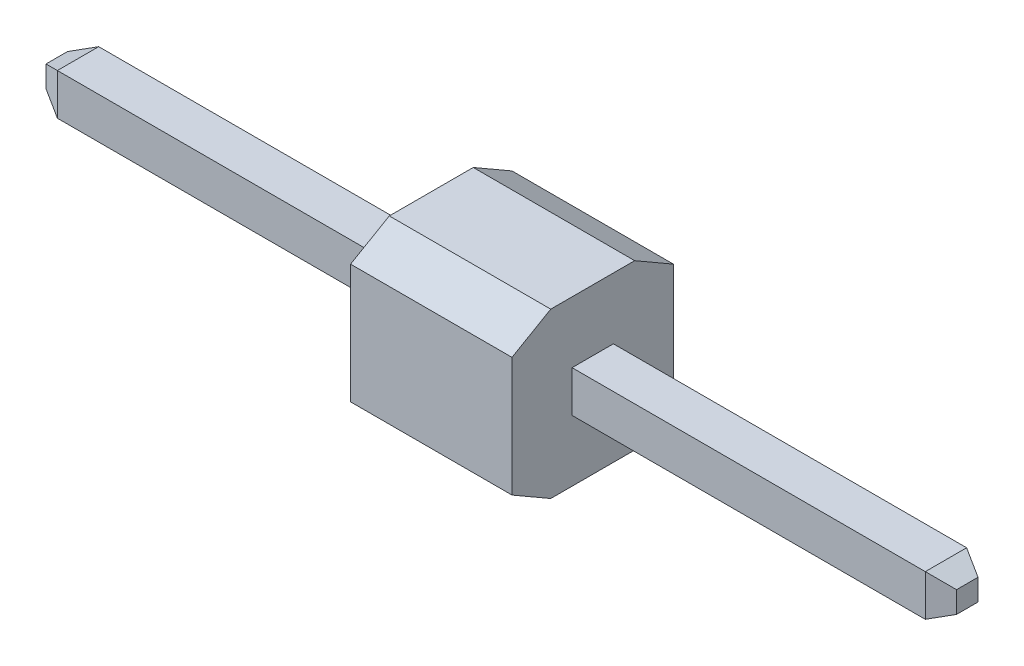
ISO-10303-21;
HEADER;
FILE_DESCRIPTION(('STEP AP214'),'2;1');
FILE_NAME('part.step','',(''),(''),'','','');
FILE_SCHEMA(('AUTOMOTIVE_DESIGN { 1 0 10303 214 1 1 1 1 }'));
ENDSEC;
DATA;
#1=APPLICATION_CONTEXT('core data for automotive mechanical design processes');
#2=APPLICATION_PROTOCOL_DEFINITION('international standard','automotive_design',2000,#1);
#3=PRODUCT_CONTEXT('',#1,'mechanical');
#4=PRODUCT('Part','Part','',(#3));
#5=PRODUCT_RELATED_PRODUCT_CATEGORY('part','',(#4));
#6=PRODUCT_DEFINITION_FORMATION('','',#4);
#7=PRODUCT_DEFINITION_CONTEXT('part definition',#1,'design');
#8=PRODUCT_DEFINITION('design','',#6,#7);
#9=PRODUCT_DEFINITION_SHAPE('','',#8);
#10=(LENGTH_UNIT() NAMED_UNIT(*) SI_UNIT(.MILLI.,.METRE.));
#11=(NAMED_UNIT(*) PLANE_ANGLE_UNIT() SI_UNIT($,.RADIAN.));
#12=(NAMED_UNIT(*) SI_UNIT($,.STERADIAN.) SOLID_ANGLE_UNIT());
#13=UNCERTAINTY_MEASURE_WITH_UNIT(LENGTH_MEASURE(1.E-05),#10,'distance_accuracy_value','');
#14=(GEOMETRIC_REPRESENTATION_CONTEXT(3) GLOBAL_UNCERTAINTY_ASSIGNED_CONTEXT((#13)) GLOBAL_UNIT_ASSIGNED_CONTEXT((#10,
#11,#12)) REPRESENTATION_CONTEXT('',''));
#15=CARTESIAN_POINT('',(0.,0.,0.));
#16=DIRECTION('',(0.,0.,1.));
#17=DIRECTION('',(1.,0.,0.));
#18=AXIS2_PLACEMENT_3D('',#15,#16,#17);
#19=CARTESIAN_POINT('',(5.42110095234498,5.39711572605714,-2.77112103967247));
#20=DIRECTION('',(1.,-9.93476518829084E-08,4.37113882867379E-08));
#21=DIRECTION('',(-9.93476589883358E-08,-1.,8.74227765734759E-08));
#22=AXIS2_PLACEMENT_3D('',#19,#20,#21);
#23=PLANE('',#22);
#24=DIRECTION('',(-1.18186619959584E-08,-0.500000075710541,-0.866025360072933));
#25=VECTOR('',#24,1.);
#26=CARTESIAN_POINT('',(5.42110076017037,4.15352602482091,-1.20112093095439));
#27=LINE('',#26,#25);
#28=CARTESIAN_POINT('',(5.42110076017037,4.15352602482091,-1.20112093095439));
#29=VERTEX_POINT('',#28);
#30=CARTESIAN_POINT('',(5.42110075198216,3.80711581085724,-1.80112090067026));
#31=VERTEX_POINT('',#30);
#32=EDGE_CURVE('E11',#29,#31,#27,.T.);
#33=ORIENTED_EDGE('',*,*,#32,.T.);
#34=DIRECTION('',(4.37113811813104E-08,-8.74227814926175E-08,-0.999999999999995));
#35=VECTOR('',#34,1.);
#36=CARTESIAN_POINT('',(5.42110075198216,3.80711581085724,-1.80112090067026));
#37=LINE('',#36,#35);
#38=CARTESIAN_POINT('',(5.42110080880696,3.80711569720762,-3.10112090067026));
#39=VERTEX_POINT('',#38);
#40=EDGE_CURVE('E304',#31,#39,#37,.T.);
#41=ORIENTED_EDGE('',*,*,#40,.T.);
#42=DIRECTION('',(8.75289950712043E-08,0.499999924289839,-0.866025447495711));
#43=VECTOR('',#42,1.);
#44=CARTESIAN_POINT('',(5.42110080880696,3.80711569720762,-3.10112090067026));
#45=LINE('',#44,#43);
#46=CARTESIAN_POINT('',(5.42110086944883,4.15352580626395,-3.70112093095439));
#47=VERTEX_POINT('',#46);
#48=EDGE_CURVE('E296',#39,#47,#45,.T.);
#49=ORIENTED_EDGE('',*,*,#48,.T.);
#50=DIRECTION('',(9.93476593244772E-08,0.999999999999991,-8.74227764822788E-08));
#51=VECTOR('',#50,1.);
#52=CARTESIAN_POINT('',(5.42110086944883,4.15352580626395,-3.70112093095439));
#53=LINE('',#52,#51);
#54=CARTESIAN_POINT('',(5.4211010529618,6.00070548323395,-3.70112109243997));
#55=VERTEX_POINT('',#54);
#56=EDGE_CURVE('E281',#47,#55,#53,.T.);
#57=ORIENTED_EDGE('',*,*,#56,.T.);
#58=DIRECTION('',(-1.18186632778483E-08,-0.500000075710533,-0.866025360072938));
#59=VECTOR('',#58,1.);
#60=CARTESIAN_POINT('',(5.42110106115001,6.34711569720762,-3.10112112272411));
#61=LINE('',#60,#59);
#62=CARTESIAN_POINT('',(5.42110106115001,6.34711569720762,-3.10112112272411));
#63=VERTEX_POINT('',#62);
#64=EDGE_CURVE('E265',#63,#55,#61,.T.);
#65=ORIENTED_EDGE('',*,*,#64,.F.);
#66=DIRECTION('',(4.37113811813104E-08,-8.74227842254741E-08,-0.999999999999995));
#67=VECTOR('',#66,1.);
#68=CARTESIAN_POINT('',(5.42110100432522,6.34711581085724,-1.80112112272411));
#69=LINE('',#68,#67);
#70=CARTESIAN_POINT('',(5.42110100432522,6.34711581085724,-1.80112112272411));
#71=VERTEX_POINT('',#70);
#72=EDGE_CURVE('E248',#71,#63,#69,.T.);
#73=ORIENTED_EDGE('',*,*,#72,.F.);
#74=DIRECTION('',(8.75289963525477E-08,0.499999924289836,-0.866025447495714));
#75=VECTOR('',#74,1.);
#76=CARTESIAN_POINT('',(5.42110094368335,6.00070570179091,-1.20112109243997));
#77=LINE('',#76,#75);
#78=CARTESIAN_POINT('',(5.42110094368335,6.00070570179091,-1.20112109243997));
#79=VERTEX_POINT('',#78);
#80=EDGE_CURVE('E242',#79,#71,#77,.T.);
#81=ORIENTED_EDGE('',*,*,#80,.F.);
#82=DIRECTION('',(9.93476593244772E-08,0.999999999999991,-8.74227763620714E-08));
#83=VECTOR('',#82,1.);
#84=CARTESIAN_POINT('',(5.42110076017037,4.15352602482091,-1.20112093095439));
#85=LINE('',#84,#83);
#86=EDGE_CURVE('E236',#29,#79,#85,.T.);
#87=ORIENTED_EDGE('',*,*,#86,.F.);
#88=EDGE_LOOP('',(#33,#41,#49,#57,#65,#73,#81,#87));
#89=FACE_BOUND('',#88,.T.);
#90=DIRECTION('',(-4.37113817364219E-08,8.74227856773042E-08,0.999999999999995));
#91=VECTOR('',#90,1.);
#92=CARTESIAN_POINT('',(5.42110088876248,4.75711572605714,-2.77112098372189));
#93=LINE('',#92,#91);
#94=CARTESIAN_POINT('',(5.42110088876248,4.75711572605714,-2.77112098372189));
#95=VERTEX_POINT('',#94);
#96=CARTESIAN_POINT('',(5.42110086078719,4.75711578200772,-2.13112098372189));
#97=VERTEX_POINT('',#96);
#98=EDGE_CURVE('E302',#95,#97,#93,.T.);
#99=ORIENTED_EDGE('',*,*,#98,.T.);
#100=DIRECTION('',(-9.93476592658906E-08,-0.999999999999991,8.74227766567418E-08));
#101=VECTOR('',#100,1.);
#102=CARTESIAN_POINT('',(5.4211009243697,5.39711578200772,-2.13112103967247));
#103=LINE('',#102,#101);
#104=CARTESIAN_POINT('',(5.4211009243697,5.39711578200772,-2.13112103967247));
#105=VERTEX_POINT('',#104);
#106=EDGE_CURVE('E293',#105,#97,#103,.T.);
#107=ORIENTED_EDGE('',*,*,#106,.F.);
#108=DIRECTION('',(-4.37113817364219E-08,8.74227856773042E-08,0.999999999999995));
#109=VECTOR('',#108,1.);
#110=CARTESIAN_POINT('',(5.42110095234498,5.39711572605714,-2.77112103967247));
#111=LINE('',#110,#109);
#112=CARTESIAN_POINT('',(5.42110095234498,5.39711572605714,-2.77112103967247));
#113=VERTEX_POINT('',#112);
#114=EDGE_CURVE('E278',#113,#105,#111,.T.);
#115=ORIENTED_EDGE('',*,*,#114,.F.);
#116=DIRECTION('',(-9.93476592658906E-08,-0.999999999999991,8.74227766567418E-08));
#117=VECTOR('',#116,1.);
#118=CARTESIAN_POINT('',(5.42110095234498,5.39711572605714,-2.77112103967247));
#119=LINE('',#118,#117);
#120=EDGE_CURVE('E263',#113,#95,#119,.T.);
#121=ORIENTED_EDGE('',*,*,#120,.T.);
#122=EDGE_LOOP('',(#99,#107,#115,#121));
#123=FACE_BOUND('',#122,.T.);
#124=ADVANCED_FACE('F17',(#89,#123),#23,.T.);
#125=CARTESIAN_POINT('',(2.92110095234498,5.39711597442627,-2.77112114895094));
#126=DIRECTION('',(1.,-9.93476518829084E-08,4.37113882867379E-08));
#127=DIRECTION('',(-9.93476589883358E-08,-1.,8.74227765734759E-08));
#128=AXIS2_PLACEMENT_3D('',#125,#126,#127);
#129=PLANE('',#128);
#130=DIRECTION('',(-1.1818662636946E-08,-0.500000075710541,-0.866025360072933));
#131=VECTOR('',#130,1.);
#132=CARTESIAN_POINT('',(2.92110076017037,4.15352627319004,-1.20112104023287));
#133=LINE('',#132,#131);
#134=CARTESIAN_POINT('',(2.92110076017037,4.15352627319004,-1.20112104023287));
#135=VERTEX_POINT('',#134);
#136=CARTESIAN_POINT('',(2.92110075198216,3.80711605922637,-1.80112100994873));
#137=VERTEX_POINT('',#136);
#138=EDGE_CURVE('E24',#135,#137,#133,.T.);
#139=ORIENTED_EDGE('',*,*,#138,.F.);
#140=DIRECTION('',(9.93476590840625E-08,0.999999999999991,-8.74227763620714E-08));
#141=VECTOR('',#140,1.);
#142=CARTESIAN_POINT('',(2.92110076017037,4.15352627319004,-1.20112104023287));
#143=LINE('',#142,#141);
#144=CARTESIAN_POINT('',(2.92110094368335,6.00070595016004,-1.20112120171844));
#145=VERTEX_POINT('',#144);
#146=EDGE_CURVE('E300',#135,#145,#143,.T.);
#147=ORIENTED_EDGE('',*,*,#146,.T.);
#148=DIRECTION('',(8.75289963525477E-08,0.499999924289836,-0.866025447495714));
#149=VECTOR('',#148,1.);
#150=CARTESIAN_POINT('',(2.92110094368335,6.00070595016004,-1.20112120171844));
#151=LINE('',#150,#149);
#152=CARTESIAN_POINT('',(2.92110100432522,6.34711605922637,-1.80112123200258));
#153=VERTEX_POINT('',#152);
#154=EDGE_CURVE('E286',#145,#153,#151,.T.);
#155=ORIENTED_EDGE('',*,*,#154,.T.);
#156=DIRECTION('',(4.37113811813104E-08,-8.74227842254741E-08,-0.999999999999995));
#157=VECTOR('',#156,1.);
#158=CARTESIAN_POINT('',(2.92110100432522,6.34711605922637,-1.80112123200258));
#159=LINE('',#158,#157);
#160=CARTESIAN_POINT('',(2.92110106115001,6.34711594557675,-3.10112123200258));
#161=VERTEX_POINT('',#160);
#162=EDGE_CURVE('E271',#153,#161,#159,.T.);
#163=ORIENTED_EDGE('',*,*,#162,.T.);
#164=DIRECTION('',(-1.18186632778483E-08,-0.500000075710533,-0.866025360072938));
#165=VECTOR('',#164,1.);
#166=CARTESIAN_POINT('',(2.92110106115001,6.34711594557675,-3.10112123200258));
#167=LINE('',#166,#165);
#168=CARTESIAN_POINT('',(2.9211010529618,6.00070573160308,-3.70112120171844));
#169=VERTEX_POINT('',#168);
#170=EDGE_CURVE('E253',#161,#169,#167,.T.);
#171=ORIENTED_EDGE('',*,*,#170,.T.);
#172=DIRECTION('',(9.93476590840625E-08,0.999999999999991,-8.74227764822788E-08));
#173=VECTOR('',#172,1.);
#174=CARTESIAN_POINT('',(2.92110086944883,4.15352605463308,-3.70112104023287));
#175=LINE('',#174,#173);
#176=CARTESIAN_POINT('',(2.92110086944883,4.15352605463308,-3.70112104023287));
#177=VERTEX_POINT('',#176);
#178=EDGE_CURVE('E261',#177,#169,#175,.T.);
#179=ORIENTED_EDGE('',*,*,#178,.F.);
#180=DIRECTION('',(8.75289957121919E-08,0.499999924289839,-0.866025447495711));
#181=VECTOR('',#180,1.);
#182=CARTESIAN_POINT('',(2.92110080880696,3.80711594557675,-3.10112100994873));
#183=LINE('',#182,#181);
#184=CARTESIAN_POINT('',(2.92110080880696,3.80711594557675,-3.10112100994873));
#185=VERTEX_POINT('',#184);
#186=EDGE_CURVE('E276',#185,#177,#183,.T.);
#187=ORIENTED_EDGE('',*,*,#186,.F.);
#188=DIRECTION('',(4.37113811813104E-08,-8.74227814926175E-08,-0.999999999999995));
#189=VECTOR('',#188,1.);
#190=CARTESIAN_POINT('',(2.92110075198216,3.80711605922637,-1.80112100994873));
#191=LINE('',#190,#189);
#192=EDGE_CURVE('E291',#137,#185,#191,.T.);
#193=ORIENTED_EDGE('',*,*,#192,.F.);
#194=EDGE_LOOP('',(#139,#147,#155,#163,#171,#179,#187,#193));
#195=FACE_BOUND('',#194,.T.);
#196=DIRECTION('',(-9.93476592658906E-08,-0.999999999999991,8.74227766567418E-08));
#197=VECTOR('',#196,1.);
#198=CARTESIAN_POINT('',(2.9211009243697,5.39711603037685,-2.13112114895094));
#199=LINE('',#198,#197);
#200=CARTESIAN_POINT('',(2.9211009243697,5.39711603037685,-2.13112114895094));
#201=VERTEX_POINT('',#200);
#202=CARTESIAN_POINT('',(2.92110086078719,4.75711603037685,-2.13112109300036));
#203=VERTEX_POINT('',#202);
#204=EDGE_CURVE('E298',#201,#203,#199,.T.);
#205=ORIENTED_EDGE('',*,*,#204,.T.);
#206=DIRECTION('',(-4.37113817364219E-08,8.74227856773042E-08,0.999999999999995));
#207=VECTOR('',#206,1.);
#208=CARTESIAN_POINT('',(2.92110088876248,4.75711597442627,-2.77112109300037));
#209=LINE('',#208,#207);
#210=CARTESIAN_POINT('',(2.92110088876248,4.75711597442627,-2.77112109300037));
#211=VERTEX_POINT('',#210);
#212=EDGE_CURVE('E283',#211,#203,#209,.T.);
#213=ORIENTED_EDGE('',*,*,#212,.F.);
#214=DIRECTION('',(-9.93476585720012E-08,-0.999999999999991,8.74227766567418E-08));
#215=VECTOR('',#214,1.);
#216=CARTESIAN_POINT('',(2.92110095234498,5.39711597442627,-2.77112114895094));
#217=LINE('',#216,#215);
#218=CARTESIAN_POINT('',(2.92110095234498,5.39711597442627,-2.77112114895094));
#219=VERTEX_POINT('',#218);
#220=EDGE_CURVE('E268',#219,#211,#217,.T.);
#221=ORIENTED_EDGE('',*,*,#220,.F.);
#222=DIRECTION('',(-4.37113810425325E-08,8.74227856773042E-08,0.999999999999995));
#223=VECTOR('',#222,1.);
#224=CARTESIAN_POINT('',(2.92110095234498,5.39711597442627,-2.77112114895094));
#225=LINE('',#224,#223);
#226=EDGE_CURVE('E251',#219,#201,#225,.T.);
#227=ORIENTED_EDGE('',*,*,#226,.T.);
#228=EDGE_LOOP('',(#205,#213,#221,#227));
#229=FACE_BOUND('',#228,.T.);
#230=ADVANCED_FACE('F314',(#195,#229),#129,.F.);
#231=CARTESIAN_POINT('',(5.42110076017037,4.15352602482091,-1.20112093095439));
#232=DIRECTION('',(1.07893287081065E-07,0.866025360072937,-0.500000075710535));
#233=DIRECTION('',(1.18186629566715E-08,0.500000075710542,0.866025360072941));
#234=AXIS2_PLACEMENT_3D('',#231,#232,#233);
#235=PLANE('',#234);
#236=ORIENTED_EDGE('',*,*,#138,.T.);
#237=DIRECTION('',(-0.999999999999994,9.93476504618223E-08,-4.37113883755555E-08));
#238=VECTOR('',#237,1.);
#239=CARTESIAN_POINT('',(5.42110075198216,3.80711581085724,-1.80112090067026));
#240=LINE('',#239,#238);
#241=EDGE_CURVE('E288',#31,#137,#240,.T.);
#242=ORIENTED_EDGE('',*,*,#241,.F.);
#243=ORIENTED_EDGE('',*,*,#32,.F.);
#244=DIRECTION('',(-0.999999999999994,9.93476504618224E-08,-4.3711388109102E-08));
#245=VECTOR('',#244,1.);
#246=CARTESIAN_POINT('',(5.42110076017037,4.15352602482091,-1.20112093095439));
#247=LINE('',#246,#245);
#248=EDGE_CURVE('E256',#29,#135,#247,.T.);
#249=ORIENTED_EDGE('',*,*,#248,.T.);
#250=EDGE_LOOP('',(#236,#242,#243,#249));
#251=FACE_BOUND('',#250,.T.);
#252=ADVANCED_FACE('F306',(#251),#235,.F.);
#253=CARTESIAN_POINT('',(5.42110075198216,3.80711581085724,-1.80112090067026));
#254=DIRECTION('',(9.93476589883358E-08,1.,-8.74227765734759E-08));
#255=DIRECTION('',(1.,-9.93476518829084E-08,4.37113882867379E-08));
#256=AXIS2_PLACEMENT_3D('',#253,#254,#255);
#257=PLANE('',#256);
#258=ORIENTED_EDGE('',*,*,#192,.T.);
#259=DIRECTION('',(-0.999999999999994,9.93476504618223E-08,-4.37113882867377E-08));
#260=VECTOR('',#259,1.);
#261=CARTESIAN_POINT('',(5.42110080880696,3.80711569720762,-3.10112090067026));
#262=LINE('',#261,#260);
#263=EDGE_CURVE('E273',#39,#185,#262,.T.);
#264=ORIENTED_EDGE('',*,*,#263,.F.);
#265=ORIENTED_EDGE('',*,*,#40,.F.);
#266=ORIENTED_EDGE('',*,*,#241,.T.);
#267=EDGE_LOOP('',(#258,#264,#265,#266));
#268=FACE_BOUND('',#267,.T.);
#269=ADVANCED_FACE('F311',(#268),#257,.F.);
#270=CARTESIAN_POINT('',(5.42110080880696,3.80711569720762,-3.10112090067026));
#271=DIRECTION('',(6.41819058997377E-08,0.866025447495721,0.499999924289845));
#272=DIRECTION('',(-8.7528996031702E-08,-0.499999924289838,0.866025447495717));
#273=AXIS2_PLACEMENT_3D('',#270,#271,#272);
#274=PLANE('',#273);
#275=ORIENTED_EDGE('',*,*,#186,.T.);
#276=DIRECTION('',(-0.999999999999994,9.93476504618224E-08,-4.37113882867377E-08));
#277=VECTOR('',#276,1.);
#278=CARTESIAN_POINT('',(5.42110086944883,4.15352580626395,-3.70112093095439));
#279=LINE('',#278,#277);
#280=EDGE_CURVE('E258',#47,#177,#279,.T.);
#281=ORIENTED_EDGE('',*,*,#280,.F.);
#282=ORIENTED_EDGE('',*,*,#48,.F.);
#283=ORIENTED_EDGE('',*,*,#263,.T.);
#284=EDGE_LOOP('',(#275,#281,#282,#283));
#285=FACE_BOUND('',#284,.T.);
#286=ADVANCED_FACE('F319',(#285),#274,.F.);
#287=CARTESIAN_POINT('',(5.42110086944883,4.15352580626395,-3.70112093095439));
#288=DIRECTION('',(-4.37113811813106E-08,8.74227836789032E-08,1.));
#289=DIRECTION('',(-1.,9.93476518829084E-08,-4.37113882867379E-08));
#290=AXIS2_PLACEMENT_3D('',#287,#288,#289);
#291=PLANE('',#290);
#292=ORIENTED_EDGE('',*,*,#178,.T.);
#293=DIRECTION('',(-0.999999999999994,9.93476504618223E-08,-4.37113882867377E-08));
#294=VECTOR('',#293,1.);
#295=CARTESIAN_POINT('',(5.4211010529618,6.00070548323395,-3.70112109243997));
#296=LINE('',#295,#294);
#297=EDGE_CURVE('E245',#55,#169,#296,.T.);
#298=ORIENTED_EDGE('',*,*,#297,.F.);
#299=ORIENTED_EDGE('',*,*,#56,.F.);
#300=ORIENTED_EDGE('',*,*,#280,.T.);
#301=EDGE_LOOP('',(#292,#298,#299,#300));
#302=FACE_BOUND('',#301,.T.);
#303=ADVANCED_FACE('F326',(#302),#291,.F.);
#304=CARTESIAN_POINT('',(5.42110106115001,6.34711569720762,-3.10112112272411));
#305=DIRECTION('',(1.07893287081065E-07,0.866025360072937,-0.500000075710535));
#306=DIRECTION('',(1.18186629566715E-08,0.500000075710542,0.866025360072941));
#307=AXIS2_PLACEMENT_3D('',#304,#305,#306);
#308=PLANE('',#307);
#309=ORIENTED_EDGE('',*,*,#170,.F.);
#310=DIRECTION('',(-0.999999999999994,9.93476533039933E-08,-4.37113882867377E-08));
#311=VECTOR('',#310,1.);
#312=CARTESIAN_POINT('',(5.42110106115001,6.34711569720762,-3.10112112272411));
#313=LINE('',#312,#311);
#314=EDGE_CURVE('E239',#63,#161,#313,.T.);
#315=ORIENTED_EDGE('',*,*,#314,.F.);
#316=ORIENTED_EDGE('',*,*,#64,.T.);
#317=ORIENTED_EDGE('',*,*,#297,.T.);
#318=EDGE_LOOP('',(#309,#315,#316,#317));
#319=FACE_BOUND('',#318,.T.);
#320=ADVANCED_FACE('F329',(#319),#308,.T.);
#321=CARTESIAN_POINT('',(5.42110100432522,6.34711581085724,-1.80112112272411));
#322=DIRECTION('',(9.93476589883358E-08,1.,-8.74227765734759E-08));
#323=DIRECTION('',(1.,-9.93476518829084E-08,4.37113882867379E-08));
#324=AXIS2_PLACEMENT_3D('',#321,#322,#323);
#325=PLANE('',#324);
#326=ORIENTED_EDGE('',*,*,#162,.F.);
#327=DIRECTION('',(-0.999999999999994,9.93476533039933E-08,-4.37113882867377E-08));
#328=VECTOR('',#327,1.);
#329=CARTESIAN_POINT('',(5.42110100432522,6.34711581085724,-1.80112112272411));
#330=LINE('',#329,#328);
#331=EDGE_CURVE('E233',#71,#153,#330,.T.);
#332=ORIENTED_EDGE('',*,*,#331,.F.);
#333=ORIENTED_EDGE('',*,*,#72,.T.);
#334=ORIENTED_EDGE('',*,*,#314,.T.);
#335=EDGE_LOOP('',(#326,#332,#333,#334));
#336=FACE_BOUND('',#335,.T.);
#337=ADVANCED_FACE('F333',(#336),#325,.T.);
#338=CARTESIAN_POINT('',(5.42110094368335,6.00070570179091,-1.20112109243997));
#339=DIRECTION('',(6.41819058997377E-08,0.866025447495721,0.499999924289845));
#340=DIRECTION('',(-8.7528996031702E-08,-0.499999924289838,0.866025447495717));
#341=AXIS2_PLACEMENT_3D('',#338,#339,#340);
#342=PLANE('',#341);
#343=ORIENTED_EDGE('',*,*,#154,.F.);
#344=DIRECTION('',(-0.999999999999994,9.93476504618223E-08,-4.3711388109102E-08));
#345=VECTOR('',#344,1.);
#346=CARTESIAN_POINT('',(5.42110094368335,6.00070570179091,-1.20112109243997));
#347=LINE('',#346,#345);
#348=EDGE_CURVE('E230',#79,#145,#347,.T.);
#349=ORIENTED_EDGE('',*,*,#348,.F.);
#350=ORIENTED_EDGE('',*,*,#80,.T.);
#351=ORIENTED_EDGE('',*,*,#331,.T.);
#352=EDGE_LOOP('',(#343,#349,#350,#351));
#353=FACE_BOUND('',#352,.T.);
#354=ADVANCED_FACE('F337',(#353),#342,.T.);
#355=CARTESIAN_POINT('',(5.42110076017037,4.15352602482091,-1.20112093095439));
#356=DIRECTION('',(-4.37113811813106E-08,8.74227835615132E-08,1.));
#357=DIRECTION('',(-9.93476589883358E-08,-1.,8.74227764560859E-08));
#358=AXIS2_PLACEMENT_3D('',#355,#356,#357);
#359=PLANE('',#358);
#360=ORIENTED_EDGE('',*,*,#146,.F.);
#361=ORIENTED_EDGE('',*,*,#248,.F.);
#362=ORIENTED_EDGE('',*,*,#86,.T.);
#363=ORIENTED_EDGE('',*,*,#348,.T.);
#364=EDGE_LOOP('',(#360,#361,#362,#363));
#365=FACE_BOUND('',#364,.T.);
#366=ADVANCED_FACE('F339',(#365),#359,.T.);
#367=CARTESIAN_POINT('',(-2.87889904765502,5.39711655064265,-2.77112140247699));
#368=DIRECTION('',(-1.,9.93476518829084E-08,-4.37113882867379E-08));
#369=DIRECTION('',(9.93476589883358E-08,1.,-8.74227765734759E-08));
#370=AXIS2_PLACEMENT_3D('',#367,#368,#369);
#371=PLANE('',#370);
#372=DIRECTION('',(9.93476581477908E-08,0.999999999999991,-8.74227761415111E-08));
#373=VECTOR('',#372,1.);
#374=CARTESIAN_POINT('',(-2.87889911719866,4.91099812033048,-2.28500288717017));
#375=LINE('',#374,#373);
#376=CARTESIAN_POINT('',(-2.87889911719866,4.91099812033048,-2.28500288717017));
#377=VERTEX_POINT('',#376);
#378=CARTESIAN_POINT('',(-2.8788990841917,5.24323506594048,-2.28500291621524));
#379=VERTEX_POINT('',#378);
#380=EDGE_CURVE('E228',#377,#379,#375,.T.);
#381=ORIENTED_EDGE('',*,*,#380,.T.);
#382=DIRECTION('',(4.37113793813866E-08,-8.74227854960559E-08,-0.999999999999995));
#383=VECTOR('',#382,1.);
#384=CARTESIAN_POINT('',(-2.8788990841917,5.24323506594048,-2.28500291621524));
#385=LINE('',#384,#383);
#386=CARTESIAN_POINT('',(-2.87889906966916,5.2432350368954,-2.61723986183324));
#387=VERTEX_POINT('',#386);
#388=EDGE_CURVE('E223',#379,#387,#385,.T.);
#389=ORIENTED_EDGE('',*,*,#388,.T.);
#390=DIRECTION('',(-9.93476608211191E-08,-0.999999999999991,8.74227774781752E-08));
#391=VECTOR('',#390,1.);
#392=CARTESIAN_POINT('',(-2.87889906966916,5.2432350368954,-2.61723986183324));
#393=LINE('',#392,#391);
#394=CARTESIAN_POINT('',(-2.87889910267613,4.9109980912854,-2.61723983278817));
#395=VERTEX_POINT('',#394);
#396=EDGE_CURVE('E215',#387,#395,#393,.T.);
#397=ORIENTED_EDGE('',*,*,#396,.T.);
#398=DIRECTION('',(-4.37113767080584E-08,8.74227854960561E-08,0.999999999999995));
#399=VECTOR('',#398,1.);
#400=CARTESIAN_POINT('',(-2.87889910267613,4.9109980912854,-2.61723983278817));
#401=LINE('',#400,#399);
#402=EDGE_CURVE('E207',#395,#377,#401,.T.);
#403=ORIENTED_EDGE('',*,*,#402,.T.);
#404=EDGE_LOOP('',(#381,#389,#397,#403));
#405=FACE_BOUND('',#404,.T.);
#406=ADVANCED_FACE('F341',(#405),#371,.T.);
#407=CARTESIAN_POINT('',(-2.87889904765502,5.39711655064265,-2.77112140247699));
#408=DIRECTION('',(9.93476589883358E-08,1.,-8.74227764510112E-08));
#409=DIRECTION('',(-4.37113811813106E-08,8.74227835564385E-08,1.));
#410=AXIS2_PLACEMENT_3D('',#407,#408,#409);
#411=PLANE('',#410);
#412=DIRECTION('',(0.999999999999994,-9.93476521037346E-08,4.37113882769953E-08));
#413=VECTOR('',#412,1.);
#414=CARTESIAN_POINT('',(-2.54889904765502,5.39711651785793,-2.77112138805224));
#415=LINE('',#414,#413);
#416=CARTESIAN_POINT('',(-2.54889904765502,5.39711651785793,-2.77112138805224));
#417=VERTEX_POINT('',#416);
#418=EDGE_CURVE('E225',#417,#219,#415,.T.);
#419=ORIENTED_EDGE('',*,*,#418,.F.);
#420=DIRECTION('',(-4.37113817364219E-08,8.74227856773042E-08,0.999999999999995));
#421=VECTOR('',#420,1.);
#422=CARTESIAN_POINT('',(-2.54889904765502,5.39711651785793,-2.77112138805224));
#423=LINE('',#422,#421);
#424=CARTESIAN_POINT('',(-2.5488990756303,5.39711657380851,-2.13112138805224));
#425=VERTEX_POINT('',#424);
#426=EDGE_CURVE('E217',#417,#425,#423,.T.);
#427=ORIENTED_EDGE('',*,*,#426,.T.);
#428=DIRECTION('',(0.999999999999994,-9.93476521037346E-08,4.3711388195809E-08));
#429=VECTOR('',#428,1.);
#430=CARTESIAN_POINT('',(-2.5488990756303,5.39711657380851,-2.13112138805224));
#431=LINE('',#430,#429);
#432=EDGE_CURVE('E220',#425,#201,#431,.T.);
#433=ORIENTED_EDGE('',*,*,#432,.T.);
#434=ORIENTED_EDGE('',*,*,#226,.F.);
#435=EDGE_LOOP('',(#419,#427,#433,#434));
#436=FACE_BOUND('',#435,.T.);
#437=ADVANCED_FACE('F348',(#436),#411,.T.);
#438=CARTESIAN_POINT('',(-2.8788990756303,5.39711660659323,-2.13112140247699));
#439=DIRECTION('',(-4.37113811813106E-08,8.74227836789032E-08,1.));
#440=DIRECTION('',(-1.,9.93476518829084E-08,-4.37113882867379E-08));
#441=AXIS2_PLACEMENT_3D('',#438,#439,#440);
#442=PLANE('',#441);
#443=ORIENTED_EDGE('',*,*,#432,.F.);
#444=DIRECTION('',(-9.93476592658906E-08,-0.999999999999991,8.74227766567418E-08));
#445=VECTOR('',#444,1.);
#446=CARTESIAN_POINT('',(-2.5488990756303,5.39711657380851,-2.13112138805224));
#447=LINE('',#446,#445);
#448=CARTESIAN_POINT('',(-2.54889913921281,4.75711657380851,-2.13112133210166));
#449=VERTEX_POINT('',#448);
#450=EDGE_CURVE('E209',#425,#449,#447,.T.);
#451=ORIENTED_EDGE('',*,*,#450,.T.);
#452=DIRECTION('',(0.999999999999994,-9.93476521037346E-08,4.3711388195809E-08));
#453=VECTOR('',#452,1.);
#454=CARTESIAN_POINT('',(-2.54889913921281,4.75711657380851,-2.13112133210166));
#455=LINE('',#454,#453);
#456=EDGE_CURVE('E212',#449,#203,#455,.T.);
#457=ORIENTED_EDGE('',*,*,#456,.T.);
#458=ORIENTED_EDGE('',*,*,#204,.F.);
#459=EDGE_LOOP('',(#443,#451,#457,#458));
#460=FACE_BOUND('',#459,.T.);
#461=ADVANCED_FACE('F424',(#460),#442,.T.);
#462=CARTESIAN_POINT('',(-2.87889911123752,4.75711655064265,-2.77112134652642));
#463=DIRECTION('',(9.93476589883357E-08,1.,-8.74227764040693E-08));
#464=DIRECTION('',(-4.37113811813106E-08,8.74227835094966E-08,1.));
#465=AXIS2_PLACEMENT_3D('',#462,#463,#464);
#466=PLANE('',#465);
#467=ORIENTED_EDGE('',*,*,#456,.F.);
#468=DIRECTION('',(4.37113831242006E-08,-8.74227912284193E-08,-0.999999999999995));
#469=VECTOR('',#468,1.);
#470=CARTESIAN_POINT('',(-2.54889913921281,4.75711657380851,-2.13112133210166));
#471=LINE('',#470,#469);
#472=CARTESIAN_POINT('',(-2.54889911123752,4.75711651785793,-2.77112133210166));
#473=VERTEX_POINT('',#472);
#474=EDGE_CURVE('E201',#449,#473,#471,.T.);
#475=ORIENTED_EDGE('',*,*,#474,.T.);
#476=DIRECTION('',(0.999999999999994,-9.93476521037346E-08,4.37113882769953E-08));
#477=VECTOR('',#476,1.);
#478=CARTESIAN_POINT('',(-2.54889911123752,4.75711651785793,-2.77112133210166));
#479=LINE('',#478,#477);
#480=EDGE_CURVE('E204',#473,#211,#479,.T.);
#481=ORIENTED_EDGE('',*,*,#480,.T.);
#482=ORIENTED_EDGE('',*,*,#212,.T.);
#483=EDGE_LOOP('',(#467,#475,#481,#482));
#484=FACE_BOUND('',#483,.T.);
#485=ADVANCED_FACE('F421',(#484),#466,.F.);
#486=CARTESIAN_POINT('',(-2.87889904765502,5.39711655064265,-2.77112140247699));
#487=DIRECTION('',(-4.37113811813106E-08,8.74227836789032E-08,1.));
#488=DIRECTION('',(-1.,9.93476518829084E-08,-4.37113882867379E-08));
#489=AXIS2_PLACEMENT_3D('',#486,#487,#488);
#490=PLANE('',#489);
#491=ORIENTED_EDGE('',*,*,#480,.F.);
#492=DIRECTION('',(9.93476578781118E-08,0.999999999999991,-8.74227766567418E-08));
#493=VECTOR('',#492,1.);
#494=CARTESIAN_POINT('',(-2.54889911123752,4.75711651785793,-2.77112133210166));
#495=LINE('',#494,#493);
#496=EDGE_CURVE('E196',#473,#417,#495,.T.);
#497=ORIENTED_EDGE('',*,*,#496,.T.);
#498=ORIENTED_EDGE('',*,*,#418,.T.);
#499=ORIENTED_EDGE('',*,*,#220,.T.);
#500=EDGE_LOOP('',(#491,#497,#498,#499));
#501=FACE_BOUND('',#500,.T.);
#502=ADVANCED_FACE('F376',(#501),#490,.F.);
#503=CARTESIAN_POINT('',(-2.87889904765502,5.39711655064265,-2.77112140247699));
#504=DIRECTION('',(-4.37113811813106E-08,8.74227836789032E-08,1.));
#505=DIRECTION('',(-1.,9.93476518829084E-08,-4.37113882867379E-08));
#506=AXIS2_PLACEMENT_3D('',#503,#504,#505);
#507=PLANE('',#506);
#508=DIRECTION('',(0.999999999999994,-9.93476521037346E-08,4.37113882769953E-08));
#509=VECTOR('',#508,1.);
#510=CARTESIAN_POINT('',(5.42110095234498,5.39711572605714,-2.77112103967247));
#511=LINE('',#510,#509);
#512=CARTESIAN_POINT('',(10.891100952345,5.39711518262548,-2.77112080057118));
#513=VERTEX_POINT('',#512);
#514=EDGE_CURVE('E199',#113,#513,#511,.T.);
#515=ORIENTED_EDGE('',*,*,#514,.T.);
#516=DIRECTION('',(-9.93476634292269E-08,-0.999999999999991,8.74227766567418E-08));
#517=VECTOR('',#516,1.);
#518=CARTESIAN_POINT('',(10.891100952345,5.39711518262548,-2.77112080057118));
#519=LINE('',#518,#517);
#520=CARTESIAN_POINT('',(10.8911008887625,4.75711518262548,-2.7711207446206));
#521=VERTEX_POINT('',#520);
#522=EDGE_CURVE('E191',#513,#521,#519,.T.);
#523=ORIENTED_EDGE('',*,*,#522,.T.);
#524=DIRECTION('',(0.999999999999994,-9.93476572996596E-08,4.37113882769953E-08));
#525=VECTOR('',#524,1.);
#526=CARTESIAN_POINT('',(5.42110088876248,4.75711572605715,-2.77112098372189));
#527=LINE('',#526,#525);
#528=EDGE_CURVE('E194',#95,#521,#527,.T.);
#529=ORIENTED_EDGE('',*,*,#528,.F.);
#530=ORIENTED_EDGE('',*,*,#120,.F.);
#531=EDGE_LOOP('',(#515,#523,#529,#530));
#532=FACE_BOUND('',#531,.T.);
#533=ADVANCED_FACE('F367',(#532),#507,.F.);
#534=CARTESIAN_POINT('',(-2.87889911123752,4.75711655064265,-2.77112134652642));
#535=DIRECTION('',(9.93476589883357E-08,1.,-8.74227764040693E-08));
#536=DIRECTION('',(-4.37113811813106E-08,8.74227835094966E-08,1.));
#537=AXIS2_PLACEMENT_3D('',#534,#535,#536);
#538=PLANE('',#537);
#539=ORIENTED_EDGE('',*,*,#528,.T.);
#540=DIRECTION('',(-4.37113817364219E-08,8.74227856773042E-08,0.999999999999995));
#541=VECTOR('',#540,1.);
#542=CARTESIAN_POINT('',(10.8911008887625,4.75711518262548,-2.7711207446206));
#543=LINE('',#542,#541);
#544=CARTESIAN_POINT('',(10.8911008607872,4.75711523857607,-2.1311207446206));
#545=VERTEX_POINT('',#544);
#546=EDGE_CURVE('E186',#521,#545,#543,.T.);
#547=ORIENTED_EDGE('',*,*,#546,.T.);
#548=DIRECTION('',(0.999999999999994,-9.93476572996596E-08,4.37113881146227E-08));
#549=VECTOR('',#548,1.);
#550=CARTESIAN_POINT('',(5.42110086078719,4.75711578200774,-2.13112098372189));
#551=LINE('',#550,#549);
#552=EDGE_CURVE('E189',#97,#545,#551,.T.);
#553=ORIENTED_EDGE('',*,*,#552,.F.);
#554=ORIENTED_EDGE('',*,*,#98,.F.);
#555=EDGE_LOOP('',(#539,#547,#553,#554));
#556=FACE_BOUND('',#555,.T.);
#557=ADVANCED_FACE('F364',(#556),#538,.F.);
#558=CARTESIAN_POINT('',(-2.8788990756303,5.39711660659323,-2.13112140247699));
#559=DIRECTION('',(-4.37113811813106E-08,8.74227836789032E-08,1.));
#560=DIRECTION('',(-1.,9.93476518829084E-08,-4.37113882867379E-08));
#561=AXIS2_PLACEMENT_3D('',#558,#559,#560);
#562=PLANE('',#561);
#563=ORIENTED_EDGE('',*,*,#552,.T.);
#564=DIRECTION('',(9.93476578781118E-08,0.999999999999991,-8.74227759628524E-08));
#565=VECTOR('',#564,1.);
#566=CARTESIAN_POINT('',(10.8911008607872,4.75711523857607,-2.1311207446206));
#567=LINE('',#566,#565);
#568=CARTESIAN_POINT('',(10.8911009243697,5.39711523857607,-2.13112080057118));
#569=VERTEX_POINT('',#568);
#570=EDGE_CURVE('E176',#545,#569,#567,.T.);
#571=ORIENTED_EDGE('',*,*,#570,.T.);
#572=DIRECTION('',(0.999999999999994,-9.93476521037346E-08,4.37113881146227E-08));
#573=VECTOR('',#572,1.);
#574=CARTESIAN_POINT('',(5.4211009243697,5.39711578200772,-2.13112103967247));
#575=LINE('',#574,#573);
#576=EDGE_CURVE('E179',#105,#569,#575,.T.);
#577=ORIENTED_EDGE('',*,*,#576,.F.);
#578=ORIENTED_EDGE('',*,*,#106,.T.);
#579=EDGE_LOOP('',(#563,#571,#577,#578));
#580=FACE_BOUND('',#579,.T.);
#581=ADVANCED_FACE('F366',(#580),#562,.T.);
#582=CARTESIAN_POINT('',(-2.87889904765502,5.39711655064265,-2.77112140247699));
#583=DIRECTION('',(9.93476589883358E-08,1.,-8.74227764510112E-08));
#584=DIRECTION('',(-4.37113811813106E-08,8.74227835564385E-08,1.));
#585=AXIS2_PLACEMENT_3D('',#582,#583,#584);
#586=PLANE('',#585);
#587=ORIENTED_EDGE('',*,*,#576,.T.);
#588=DIRECTION('',(4.37113817364219E-08,-8.74227912284193E-08,-0.999999999999995));
#589=VECTOR('',#588,1.);
#590=CARTESIAN_POINT('',(10.8911009243697,5.39711523857607,-2.13112080057118));
#591=LINE('',#590,#589);
#592=EDGE_CURVE('E167',#569,#513,#591,.T.);
#593=ORIENTED_EDGE('',*,*,#592,.T.);
#594=ORIENTED_EDGE('',*,*,#514,.F.);
#595=ORIENTED_EDGE('',*,*,#114,.T.);
#596=EDGE_LOOP('',(#587,#593,#594,#595));
#597=FACE_BOUND('',#596,.T.);
#598=ADVANCED_FACE('F373',(#597),#586,.T.);
#599=CARTESIAN_POINT('',(11.221100952345,5.39711514984076,-2.77112078614642));
#600=DIRECTION('',(-1.,9.93476518829084E-08,-4.37113882867379E-08));
#601=DIRECTION('',(9.93476589883358E-08,1.,-8.74227765734759E-08));
#602=AXIS2_PLACEMENT_3D('',#599,#600,#601);
#603=PLANE('',#602);
#604=DIRECTION('',(-9.93476581477908E-08,-0.999999999999991,8.74227774781752E-08));
#605=VECTOR('',#604,1.);
#606=CARTESIAN_POINT('',(11.2211009158083,5.24323366513859,-2.28500229988467));
#607=LINE('',#606,#605);
#608=CARTESIAN_POINT('',(11.2211009158083,5.24323366513859,-2.28500229988467));
#609=VERTEX_POINT('',#608);
#610=CARTESIAN_POINT('',(11.2211008828013,4.91099671952859,-2.28500227083959));
#611=VERTEX_POINT('',#610);
#612=EDGE_CURVE('E153',#609,#611,#607,.T.);
#613=ORIENTED_EDGE('',*,*,#612,.T.);
#614=DIRECTION('',(4.37113820547149E-08,-8.74227854960559E-08,-0.999999999999995));
#615=VECTOR('',#614,1.);
#616=CARTESIAN_POINT('',(11.2211008828013,4.91099671952859,-2.28500227083959));
#617=LINE('',#616,#615);
#618=CARTESIAN_POINT('',(11.2211008973239,4.91099669048351,-2.61723921645759));
#619=VERTEX_POINT('',#618);
#620=EDGE_CURVE('E395',#611,#619,#617,.T.);
#621=ORIENTED_EDGE('',*,*,#620,.T.);
#622=DIRECTION('',(9.93476581477908E-08,0.999999999999991,-8.74227761415111E-08));
#623=VECTOR('',#622,1.);
#624=CARTESIAN_POINT('',(11.2211008973239,4.91099669048351,-2.61723921645759));
#625=LINE('',#624,#623);
#626=CARTESIAN_POINT('',(11.2211009303308,5.24323363609351,-2.61723924550267));
#627=VERTEX_POINT('',#626);
#628=EDGE_CURVE('E156',#619,#627,#625,.T.);
#629=ORIENTED_EDGE('',*,*,#628,.T.);
#630=DIRECTION('',(-4.37113874013715E-08,8.7422774802743E-08,0.999999999999995));
#631=VECTOR('',#630,1.);
#632=CARTESIAN_POINT('',(11.2211009303308,5.24323363609351,-2.61723924550267));
#633=LINE('',#632,#631);
#634=EDGE_CURVE('E149',#627,#609,#633,.T.);
#635=ORIENTED_EDGE('',*,*,#634,.T.);
#636=EDGE_LOOP('',(#613,#621,#629,#635));
#637=FACE_BOUND('',#636,.T.);
#638=ADVANCED_FACE('F151',(#637),#603,.F.);
#639=CARTESIAN_POINT('',(-2.87889909594975,4.91099807783265,-2.77112135997917));
#640=DIRECTION('',(-0.422618351780369,-0.906307745050466,6.07587120833484E-08));
#641=DIRECTION('',(4.37113811813106E-08,-8.74227835094966E-08,-1.));
#642=AXIS2_PLACEMENT_3D('',#639,#640,#641);
#643=PLANE('',#642);
#644=DIRECTION('',(0.834817073788752,-0.389281669540033,0.389281691158098));
#645=VECTOR('',#644,1.);
#646=CARTESIAN_POINT('',(-2.87889911719868,4.91099812032996,-2.28500288717065));
#647=LINE('',#646,#645);
#648=EDGE_CURVE('E181',#377,#449,#647,.T.);
#649=ORIENTED_EDGE('',*,*,#648,.F.);
#650=ORIENTED_EDGE('',*,*,#402,.F.);
#651=DIRECTION('',(-0.834817107820823,0.389281737604207,0.389281550111904));
#652=VECTOR('',#651,1.);
#653=CARTESIAN_POINT('',(-2.54889911123795,4.75711651785646,-2.77112133210112));
#654=LINE('',#653,#652);
#655=EDGE_CURVE('E404',#473,#395,#654,.T.);
#656=ORIENTED_EDGE('',*,*,#655,.F.);
#657=ORIENTED_EDGE('',*,*,#474,.F.);
#658=EDGE_LOOP('',(#649,#650,#656,#657));
#659=FACE_BOUND('',#658,.T.);
#660=ADVANCED_FACE('F418',(#659),#643,.T.);
#661=CARTESIAN_POINT('',(-2.87889905438139,5.3971165640954,-2.61723987528599));
#662=DIRECTION('',(-0.422618222124847,-3.72458176658199E-08,-0.906307805509828));
#663=DIRECTION('',(9.93476589883358E-08,1.,-8.74227765734759E-08));
#664=AXIS2_PLACEMENT_3D('',#661,#662,#663);
#665=PLANE('',#664);
#666=ORIENTED_EDGE('',*,*,#655,.T.);
#667=ORIENTED_EDGE('',*,*,#396,.F.);
#668=DIRECTION('',(-0.834817185169258,-0.389281503665794,0.389281618176064));
#669=VECTOR('',#668,1.);
#670=CARTESIAN_POINT('',(-2.54889904765387,5.3971165178552,-2.77112138805251));
#671=LINE('',#670,#669);
#672=EDGE_CURVE('E160',#417,#387,#671,.T.);
#673=ORIENTED_EDGE('',*,*,#672,.F.);
#674=ORIENTED_EDGE('',*,*,#496,.F.);
#675=EDGE_LOOP('',(#666,#667,#673,#674));
#676=FACE_BOUND('',#675,.T.);
#677=ADVANCED_FACE('F434',(#676),#665,.T.);
#678=CARTESIAN_POINT('',(-2.5488990756303,5.39711657380851,-2.13112138805224));
#679=DIRECTION('',(0.422618301356777,-1.21218081559392E-07,-0.906307768563367));
#680=DIRECTION('',(-9.93476589883358E-08,-1.,8.74227765734759E-08));
#681=AXIS2_PLACEMENT_3D('',#678,#679,#680);
#682=PLANE('',#681);
#683=ORIENTED_EDGE('',*,*,#648,.T.);
#684=ORIENTED_EDGE('',*,*,#450,.F.);
#685=DIRECTION('',(0.834817151137179,0.38928157172997,0.389281623093935));
#686=VECTOR('',#685,1.);
#687=CARTESIAN_POINT('',(-2.87889908419453,5.24323506594802,-2.2850029162167));
#688=LINE('',#687,#686);
#689=EDGE_CURVE('E170',#379,#425,#688,.T.);
#690=ORIENTED_EDGE('',*,*,#689,.F.);
#691=ORIENTED_EDGE('',*,*,#380,.F.);
#692=EDGE_LOOP('',(#683,#684,#690,#691));
#693=FACE_BOUND('',#692,.T.);
#694=ADVANCED_FACE('F413',(#693),#682,.F.);
#695=CARTESIAN_POINT('',(-2.54889904765502,5.39711651785793,-2.77112138805224));
#696=DIRECTION('',(0.422618171701255,-0.906307829022729,9.770517399793E-08));
#697=DIRECTION('',(-4.37113811813106E-08,8.74227835564385E-08,1.));
#698=AXIS2_PLACEMENT_3D('',#695,#696,#697);
#699=PLANE('',#698);
#700=ORIENTED_EDGE('',*,*,#672,.T.);
#701=ORIENTED_EDGE('',*,*,#388,.F.);
#702=ORIENTED_EDGE('',*,*,#689,.T.);
#703=ORIENTED_EDGE('',*,*,#426,.F.);
#704=EDGE_LOOP('',(#700,#701,#702,#703));
#705=FACE_BOUND('',#704,.T.);
#706=ADVANCED_FACE('F429',(#705),#699,.F.);
#707=CARTESIAN_POINT('',(11.2211009370572,5.24323362264076,-2.77112077269367));
#708=DIRECTION('',(0.422618351780369,0.906307745050466,-6.07587121258922E-08));
#709=DIRECTION('',(4.37113811813106E-08,-8.74227835564385E-08,-1.));
#710=AXIS2_PLACEMENT_3D('',#707,#708,#709);
#711=PLANE('',#710);
#712=DIRECTION('',(-0.834817107820825,0.389281737604201,0.389281550111904));
#713=VECTOR('',#712,1.);
#714=CARTESIAN_POINT('',(11.2211009158083,5.24323366513911,-2.28500229988515));
#715=LINE('',#714,#713);
#716=EDGE_CURVE('E164',#609,#569,#715,.T.);
#717=ORIENTED_EDGE('',*,*,#716,.F.);
#718=ORIENTED_EDGE('',*,*,#634,.F.);
#719=DIRECTION('',(0.834817073788751,-0.389281669540036,0.389281691158099));
#720=VECTOR('',#719,1.);
#721=CARTESIAN_POINT('',(10.891100952345,5.39711518262548,-2.77112080057118));
#722=LINE('',#721,#720);
#723=EDGE_CURVE('E392',#513,#627,#722,.T.);
#724=ORIENTED_EDGE('',*,*,#723,.F.);
#725=ORIENTED_EDGE('',*,*,#592,.F.);
#726=EDGE_LOOP('',(#717,#718,#724,#725));
#727=FACE_BOUND('',#726,.T.);
#728=ADVANCED_FACE('F165',(#727),#711,.T.);
#729=CARTESIAN_POINT('',(10.891100952345,5.39711518262548,-2.77112080057118));
#730=DIRECTION('',(-0.422618301356777,1.21218081559392E-07,0.906307768563367));
#731=DIRECTION('',(-9.93476589883358E-08,-1.,8.74227765734759E-08));
#732=AXIS2_PLACEMENT_3D('',#729,#730,#731);
#733=PLANE('',#732);
#734=ORIENTED_EDGE('',*,*,#723,.T.);
#735=ORIENTED_EDGE('',*,*,#628,.F.);
#736=DIRECTION('',(0.834817151137181,0.389281571729967,0.389281623093935));
#737=VECTOR('',#736,1.);
#738=CARTESIAN_POINT('',(10.891100888764,4.75711518262128,-2.7711207446197));
#739=LINE('',#738,#737);
#740=EDGE_CURVE('E389',#521,#619,#739,.T.);
#741=ORIENTED_EDGE('',*,*,#740,.F.);
#742=ORIENTED_EDGE('',*,*,#522,.F.);
#743=EDGE_LOOP('',(#734,#735,#741,#742));
#744=FACE_BOUND('',#743,.T.);
#745=ADVANCED_FACE('F390',(#744),#733,.F.);
#746=CARTESIAN_POINT('',(11.2211009310961,5.39711519233859,-2.28500231333742));
#747=DIRECTION('',(0.422618222124847,3.72458176658199E-08,0.906307805509828));
#748=DIRECTION('',(9.93476589883358E-08,1.,-8.74227765734759E-08));
#749=AXIS2_PLACEMENT_3D('',#746,#747,#748);
#750=PLANE('',#749);
#751=ORIENTED_EDGE('',*,*,#716,.T.);
#752=ORIENTED_EDGE('',*,*,#570,.F.);
#753=DIRECTION('',(-0.834817185169257,-0.389281503665798,0.389281618176062));
#754=VECTOR('',#753,1.);
#755=CARTESIAN_POINT('',(11.2211008828014,4.91099671952807,-2.28500227084008));
#756=LINE('',#755,#754);
#757=EDGE_CURVE('E175',#611,#545,#756,.T.);
#758=ORIENTED_EDGE('',*,*,#757,.F.);
#759=ORIENTED_EDGE('',*,*,#612,.F.);
#760=EDGE_LOOP('',(#751,#752,#758,#759));
#761=FACE_BOUND('',#760,.T.);
#762=ADVANCED_FACE('F173',(#761),#750,.T.);
#763=CARTESIAN_POINT('',(10.8911008887625,4.75711518262548,-2.7711207446206));
#764=DIRECTION('',(-0.422618171701255,0.906307829022729,-9.77051739553862E-08));
#765=DIRECTION('',(-4.37113811813106E-08,8.74227835094966E-08,1.));
#766=AXIS2_PLACEMENT_3D('',#763,#764,#765);
#767=PLANE('',#766);
#768=ORIENTED_EDGE('',*,*,#740,.T.);
#769=ORIENTED_EDGE('',*,*,#620,.F.);
#770=ORIENTED_EDGE('',*,*,#757,.T.);
#771=ORIENTED_EDGE('',*,*,#546,.F.);
#772=EDGE_LOOP('',(#768,#769,#770,#771));
#773=FACE_BOUND('',#772,.T.);
#774=ADVANCED_FACE('F394',(#773),#767,.F.);
#775=CLOSED_SHELL('',(#124,#230,#252,#269,#286,#303,#320,#337,#354,#366,#406,#437,#461,#485,
#502,#533,#557,#581,#598,#638,#660,#677,#694,#706,#728,#745,#762,#774));
#776=MANIFOLD_SOLID_BREP('B1',#775);
#777=ADVANCED_BREP_SHAPE_REPRESENTATION('',(#18,#776),#14);
#778=SHAPE_DEFINITION_REPRESENTATION(#9,#777);
ENDSEC;
END-ISO-10303-21;
